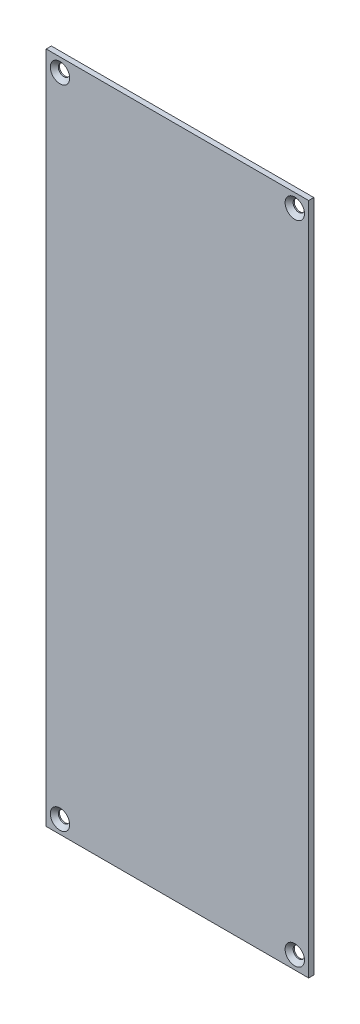
ISO-10303-21;
HEADER;
FILE_DESCRIPTION(('STEP AP214'),'2;1');
FILE_NAME('part.step','',(''),(''),'','','');
FILE_SCHEMA(('AUTOMOTIVE_DESIGN { 1 0 10303 214 1 1 1 1 }'));
ENDSEC;
DATA;
#1=APPLICATION_CONTEXT('core data for automotive mechanical design processes');
#2=APPLICATION_PROTOCOL_DEFINITION('international standard','automotive_design',2000,#1);
#3=PRODUCT_CONTEXT('',#1,'mechanical');
#4=PRODUCT('Part','Part','',(#3));
#5=PRODUCT_RELATED_PRODUCT_CATEGORY('part','',(#4));
#6=PRODUCT_DEFINITION_FORMATION('','',#4);
#7=PRODUCT_DEFINITION_CONTEXT('part definition',#1,'design');
#8=PRODUCT_DEFINITION('design','',#6,#7);
#9=PRODUCT_DEFINITION_SHAPE('','',#8);
#10=(LENGTH_UNIT() NAMED_UNIT(*) SI_UNIT(.MILLI.,.METRE.));
#11=(NAMED_UNIT(*) PLANE_ANGLE_UNIT() SI_UNIT($,.RADIAN.));
#12=(NAMED_UNIT(*) SI_UNIT($,.STERADIAN.) SOLID_ANGLE_UNIT());
#13=UNCERTAINTY_MEASURE_WITH_UNIT(LENGTH_MEASURE(1.E-05),#10,'distance_accuracy_value','');
#14=(GEOMETRIC_REPRESENTATION_CONTEXT(3) GLOBAL_UNCERTAINTY_ASSIGNED_CONTEXT((#13)) GLOBAL_UNIT_ASSIGNED_CONTEXT((#10,
#11,#12)) REPRESENTATION_CONTEXT('',''));
#15=CARTESIAN_POINT('',(0.,0.,0.));
#16=DIRECTION('',(0.,0.,1.));
#17=DIRECTION('',(1.,0.,0.));
#18=AXIS2_PLACEMENT_3D('',#15,#16,#17);
#19=CARTESIAN_POINT('',(50.8,130.33,1.));
#20=DIRECTION('',(0.,-1.,0.));
#21=DIRECTION('',(0.,0.,-1.));
#22=AXIS2_PLACEMENT_3D('',#19,#20,#21);
#23=PLANE('',#22);
#24=DIRECTION('',(-1.,0.,0.));
#25=VECTOR('',#24,1.);
#26=CARTESIAN_POINT('',(50.8,130.33,0.));
#27=LINE('',#26,#25);
#28=CARTESIAN_POINT('',(50.8,130.33,0.));
#29=VERTEX_POINT('',#28);
#30=CARTESIAN_POINT('',(0.,130.33,0.));
#31=VERTEX_POINT('',#30);
#32=EDGE_CURVE('E98',#29,#31,#27,.T.);
#33=ORIENTED_EDGE('',*,*,#32,.T.);
#34=DIRECTION('',(0.,0.,-1.));
#35=VECTOR('',#34,1.);
#36=CARTESIAN_POINT('',(0.,130.33,1.));
#37=LINE('',#36,#35);
#38=CARTESIAN_POINT('',(0.,130.33,1.));
#39=VERTEX_POINT('',#38);
#40=EDGE_CURVE('E11',#39,#31,#37,.T.);
#41=ORIENTED_EDGE('',*,*,#40,.F.);
#42=DIRECTION('',(-1.,0.,0.));
#43=VECTOR('',#42,1.);
#44=CARTESIAN_POINT('',(50.8,130.33,1.));
#45=LINE('',#44,#43);
#46=CARTESIAN_POINT('',(50.8,130.33,1.));
#47=VERTEX_POINT('',#46);
#48=EDGE_CURVE('E86',#47,#39,#45,.T.);
#49=ORIENTED_EDGE('',*,*,#48,.F.);
#50=DIRECTION('',(0.,0.,-1.));
#51=VECTOR('',#50,1.);
#52=CARTESIAN_POINT('',(50.8,130.33,1.));
#53=LINE('',#52,#51);
#54=EDGE_CURVE('E94',#47,#29,#53,.T.);
#55=ORIENTED_EDGE('',*,*,#54,.T.);
#56=EDGE_LOOP('',(#33,#41,#49,#55));
#57=FACE_BOUND('',#56,.T.);
#58=ADVANCED_FACE('F35',(#57),#23,.F.);
#59=CARTESIAN_POINT('',(0.,130.33,1.));
#60=DIRECTION('',(1.,0.,0.));
#61=DIRECTION('',(0.,1.,0.));
#62=AXIS2_PLACEMENT_3D('',#59,#60,#61);
#63=PLANE('',#62);
#64=DIRECTION('',(0.,-1.,0.));
#65=VECTOR('',#64,1.);
#66=CARTESIAN_POINT('',(0.,130.33,0.));
#67=LINE('',#66,#65);
#68=CARTESIAN_POINT('',(0.,0.,0.));
#69=VERTEX_POINT('',#68);
#70=EDGE_CURVE('E90',#31,#69,#67,.T.);
#71=ORIENTED_EDGE('',*,*,#70,.T.);
#72=DIRECTION('',(0.,0.,-1.));
#73=VECTOR('',#72,1.);
#74=CARTESIAN_POINT('',(0.,0.,1.));
#75=LINE('',#74,#73);
#76=CARTESIAN_POINT('',(0.,0.,1.));
#77=VERTEX_POINT('',#76);
#78=EDGE_CURVE('E43',#77,#69,#75,.T.);
#79=ORIENTED_EDGE('',*,*,#78,.F.);
#80=DIRECTION('',(0.,-1.,0.));
#81=VECTOR('',#80,1.);
#82=CARTESIAN_POINT('',(0.,130.33,1.));
#83=LINE('',#82,#81);
#84=EDGE_CURVE('E81',#39,#77,#83,.T.);
#85=ORIENTED_EDGE('',*,*,#84,.F.);
#86=ORIENTED_EDGE('',*,*,#40,.T.);
#87=EDGE_LOOP('',(#71,#79,#85,#86));
#88=FACE_BOUND('',#87,.T.);
#89=ADVANCED_FACE('F89',(#88),#63,.F.);
#90=CARTESIAN_POINT('',(0.,0.,1.));
#91=DIRECTION('',(0.,1.,0.));
#92=DIRECTION('',(0.,0.,1.));
#93=AXIS2_PLACEMENT_3D('',#90,#91,#92);
#94=PLANE('',#93);
#95=DIRECTION('',(1.,0.,0.));
#96=VECTOR('',#95,1.);
#97=CARTESIAN_POINT('',(0.,0.,0.));
#98=LINE('',#97,#96);
#99=CARTESIAN_POINT('',(50.8,0.,0.));
#100=VERTEX_POINT('',#99);
#101=EDGE_CURVE('E68',#69,#100,#98,.T.);
#102=ORIENTED_EDGE('',*,*,#101,.T.);
#103=DIRECTION('',(0.,0.,-1.));
#104=VECTOR('',#103,1.);
#105=CARTESIAN_POINT('',(50.8,0.,1.));
#106=LINE('',#105,#104);
#107=CARTESIAN_POINT('',(50.8,0.,1.));
#108=VERTEX_POINT('',#107);
#109=EDGE_CURVE('E91',#108,#100,#106,.T.);
#110=ORIENTED_EDGE('',*,*,#109,.F.);
#111=DIRECTION('',(1.,0.,0.));
#112=VECTOR('',#111,1.);
#113=CARTESIAN_POINT('',(0.,0.,1.));
#114=LINE('',#113,#112);
#115=EDGE_CURVE('E84',#77,#108,#114,.T.);
#116=ORIENTED_EDGE('',*,*,#115,.F.);
#117=ORIENTED_EDGE('',*,*,#78,.T.);
#118=EDGE_LOOP('',(#102,#110,#116,#117));
#119=FACE_BOUND('',#118,.T.);
#120=ADVANCED_FACE('F92',(#119),#94,.F.);
#121=CARTESIAN_POINT('',(50.8,0.,1.));
#122=DIRECTION('',(-1.,0.,0.));
#123=DIRECTION('',(0.,0.,1.));
#124=AXIS2_PLACEMENT_3D('',#121,#122,#123);
#125=PLANE('',#124);
#126=DIRECTION('',(0.,1.,0.));
#127=VECTOR('',#126,1.);
#128=CARTESIAN_POINT('',(50.8,0.,0.));
#129=LINE('',#128,#127);
#130=EDGE_CURVE('E74',#100,#29,#129,.T.);
#131=ORIENTED_EDGE('',*,*,#130,.T.);
#132=ORIENTED_EDGE('',*,*,#54,.F.);
#133=DIRECTION('',(0.,1.,0.));
#134=VECTOR('',#133,1.);
#135=CARTESIAN_POINT('',(50.8,0.,1.));
#136=LINE('',#135,#134);
#137=EDGE_CURVE('E51',#108,#47,#136,.T.);
#138=ORIENTED_EDGE('',*,*,#137,.F.);
#139=ORIENTED_EDGE('',*,*,#109,.T.);
#140=EDGE_LOOP('',(#131,#132,#138,#139));
#141=FACE_BOUND('',#140,.T.);
#142=ADVANCED_FACE('F106',(#141),#125,.F.);
#143=CARTESIAN_POINT('',(0.,0.,1.));
#144=DIRECTION('',(0.,0.,1.));
#145=DIRECTION('',(1.,0.,0.));
#146=AXIS2_PLACEMENT_3D('',#143,#144,#145);
#147=PLANE('',#146);
#148=CARTESIAN_POINT('',(48.1225,127.7025,1.));
#149=DIRECTION('',(0.,0.,1.));
#150=DIRECTION('',(1.,0.,0.));
#151=AXIS2_PLACEMENT_3D('',#148,#149,#150);
#152=CIRCLE('',#151,1.875);
#153=CARTESIAN_POINT('',(49.9975,127.7025,1.));
#154=VERTEX_POINT('',#153);
#155=EDGE_CURVE('E144',#154,#154,#152,.T.);
#156=ORIENTED_EDGE('',*,*,#155,.F.);
#157=EDGE_LOOP('',(#156));
#158=FACE_BOUND('',#157,.T.);
#159=CARTESIAN_POINT('',(2.67249999999999,2.5625,1.));
#160=DIRECTION('',(0.,0.,1.));
#161=DIRECTION('',(1.,0.,0.));
#162=AXIS2_PLACEMENT_3D('',#159,#160,#161);
#163=CIRCLE('',#162,1.875);
#164=CARTESIAN_POINT('',(4.54749999999999,2.5625,1.));
#165=VERTEX_POINT('',#164);
#166=EDGE_CURVE('E135',#165,#165,#163,.T.);
#167=ORIENTED_EDGE('',*,*,#166,.F.);
#168=EDGE_LOOP('',(#167));
#169=FACE_BOUND('',#168,.T.);
#170=CARTESIAN_POINT('',(48.1225,2.5625,1.));
#171=DIRECTION('',(0.,0.,1.));
#172=DIRECTION('',(1.,0.,0.));
#173=AXIS2_PLACEMENT_3D('',#170,#171,#172);
#174=CIRCLE('',#173,1.875);
#175=CARTESIAN_POINT('',(49.9975,2.5625,1.));
#176=VERTEX_POINT('',#175);
#177=EDGE_CURVE('E126',#176,#176,#174,.T.);
#178=ORIENTED_EDGE('',*,*,#177,.F.);
#179=EDGE_LOOP('',(#178));
#180=FACE_BOUND('',#179,.T.);
#181=CARTESIAN_POINT('',(2.67249999999999,127.7025,1.));
#182=DIRECTION('',(0.,0.,1.));
#183=DIRECTION('',(1.,0.,0.));
#184=AXIS2_PLACEMENT_3D('',#181,#182,#183);
#185=CIRCLE('',#184,1.875);
#186=CARTESIAN_POINT('',(4.54749999999999,127.7025,1.));
#187=VERTEX_POINT('',#186);
#188=EDGE_CURVE('E117',#187,#187,#185,.T.);
#189=ORIENTED_EDGE('',*,*,#188,.F.);
#190=EDGE_LOOP('',(#189));
#191=FACE_BOUND('',#190,.T.);
#192=ORIENTED_EDGE('',*,*,#48,.T.);
#193=ORIENTED_EDGE('',*,*,#84,.T.);
#194=ORIENTED_EDGE('',*,*,#115,.T.);
#195=ORIENTED_EDGE('',*,*,#137,.T.);
#196=EDGE_LOOP('',(#192,#193,#194,#195));
#197=FACE_BOUND('',#196,.T.);
#198=ADVANCED_FACE('F82',(#158,#169,#180,#191,#197),#147,.T.);
#199=CARTESIAN_POINT('',(0.,0.,0.));
#200=DIRECTION('',(0.,0.,1.));
#201=DIRECTION('',(1.,0.,0.));
#202=AXIS2_PLACEMENT_3D('',#199,#200,#201);
#203=PLANE('',#202);
#204=CARTESIAN_POINT('',(48.1225,127.7025,0.));
#205=DIRECTION('',(0.,0.,1.));
#206=DIRECTION('',(1.,0.,0.));
#207=AXIS2_PLACEMENT_3D('',#204,#205,#206);
#208=CIRCLE('',#207,1.1);
#209=CARTESIAN_POINT('',(49.2225,127.7025,0.));
#210=VERTEX_POINT('',#209);
#211=EDGE_CURVE('E138',#210,#210,#208,.T.);
#212=ORIENTED_EDGE('',*,*,#211,.T.);
#213=EDGE_LOOP('',(#212));
#214=FACE_BOUND('',#213,.T.);
#215=CARTESIAN_POINT('',(2.67249999999999,2.5625,0.));
#216=DIRECTION('',(0.,0.,1.));
#217=DIRECTION('',(1.,0.,0.));
#218=AXIS2_PLACEMENT_3D('',#215,#216,#217);
#219=CIRCLE('',#218,1.1);
#220=CARTESIAN_POINT('',(3.77249999999999,2.5625,0.));
#221=VERTEX_POINT('',#220);
#222=EDGE_CURVE('E129',#221,#221,#219,.T.);
#223=ORIENTED_EDGE('',*,*,#222,.T.);
#224=EDGE_LOOP('',(#223));
#225=FACE_BOUND('',#224,.T.);
#226=CARTESIAN_POINT('',(48.1225,2.5625,0.));
#227=DIRECTION('',(0.,0.,1.));
#228=DIRECTION('',(1.,0.,0.));
#229=AXIS2_PLACEMENT_3D('',#226,#227,#228);
#230=CIRCLE('',#229,1.1);
#231=CARTESIAN_POINT('',(49.2225,2.5625,0.));
#232=VERTEX_POINT('',#231);
#233=EDGE_CURVE('E120',#232,#232,#230,.T.);
#234=ORIENTED_EDGE('',*,*,#233,.T.);
#235=EDGE_LOOP('',(#234));
#236=FACE_BOUND('',#235,.T.);
#237=CARTESIAN_POINT('',(2.67249999999999,127.7025,0.));
#238=DIRECTION('',(0.,0.,1.));
#239=DIRECTION('',(1.,0.,0.));
#240=AXIS2_PLACEMENT_3D('',#237,#238,#239);
#241=CIRCLE('',#240,1.1);
#242=CARTESIAN_POINT('',(3.77249999999999,127.7025,0.));
#243=VERTEX_POINT('',#242);
#244=EDGE_CURVE('E101',#243,#243,#241,.T.);
#245=ORIENTED_EDGE('',*,*,#244,.T.);
#246=EDGE_LOOP('',(#245));
#247=FACE_BOUND('',#246,.T.);
#248=ORIENTED_EDGE('',*,*,#32,.F.);
#249=ORIENTED_EDGE('',*,*,#130,.F.);
#250=ORIENTED_EDGE('',*,*,#101,.F.);
#251=ORIENTED_EDGE('',*,*,#70,.F.);
#252=EDGE_LOOP('',(#248,#249,#250,#251));
#253=FACE_BOUND('',#252,.T.);
#254=ADVANCED_FACE('F109',(#214,#225,#236,#247,#253),#203,.F.);
#255=CARTESIAN_POINT('',(2.67249999999999,127.7025,1.));
#256=DIRECTION('',(0.,0.,1.));
#257=DIRECTION('',(1.,0.,0.));
#258=AXIS2_PLACEMENT_3D('',#255,#256,#257);
#259=CYLINDRICAL_SURFACE('',#258,1.1);
#260=ORIENTED_EDGE('',*,*,#244,.F.);
#261=EDGE_LOOP('',(#260));
#262=FACE_BOUND('',#261,.T.);
#263=CARTESIAN_POINT('',(2.67249999999999,127.7025,0.225));
#264=DIRECTION('',(0.,0.,1.));
#265=DIRECTION('',(1.,0.,0.));
#266=AXIS2_PLACEMENT_3D('',#263,#264,#265);
#267=CIRCLE('',#266,1.1);
#268=CARTESIAN_POINT('',(3.77249999999999,127.7025,0.225));
#269=VERTEX_POINT('',#268);
#270=EDGE_CURVE('E114',#269,#269,#267,.T.);
#271=ORIENTED_EDGE('',*,*,#270,.T.);
#272=EDGE_LOOP('',(#271));
#273=FACE_BOUND('',#272,.T.);
#274=ADVANCED_FACE('F162',(#262,#273),#259,.F.);
#275=CARTESIAN_POINT('',(2.67249999999999,127.7025,1.));
#276=DIRECTION('',(0.,0.,1.));
#277=DIRECTION('',(1.,0.,0.));
#278=AXIS2_PLACEMENT_3D('',#275,#276,#277);
#279=CONICAL_SURFACE('',#278,1.875,0.785398163397449);
#280=ORIENTED_EDGE('',*,*,#270,.F.);
#281=EDGE_LOOP('',(#280));
#282=FACE_BOUND('',#281,.T.);
#283=ORIENTED_EDGE('',*,*,#188,.T.);
#284=EDGE_LOOP('',(#283));
#285=FACE_BOUND('',#284,.T.);
#286=ADVANCED_FACE('F159',(#282,#285),#279,.F.);
#287=CARTESIAN_POINT('',(48.1225,2.5625,1.));
#288=DIRECTION('',(0.,0.,1.));
#289=DIRECTION('',(1.,0.,0.));
#290=AXIS2_PLACEMENT_3D('',#287,#288,#289);
#291=CYLINDRICAL_SURFACE('',#290,1.1);
#292=ORIENTED_EDGE('',*,*,#233,.F.);
#293=EDGE_LOOP('',(#292));
#294=FACE_BOUND('',#293,.T.);
#295=CARTESIAN_POINT('',(48.1225,2.5625,0.225));
#296=DIRECTION('',(0.,0.,1.));
#297=DIRECTION('',(1.,0.,0.));
#298=AXIS2_PLACEMENT_3D('',#295,#296,#297);
#299=CIRCLE('',#298,1.1);
#300=CARTESIAN_POINT('',(49.2225,2.5625,0.225));
#301=VERTEX_POINT('',#300);
#302=EDGE_CURVE('E123',#301,#301,#299,.T.);
#303=ORIENTED_EDGE('',*,*,#302,.T.);
#304=EDGE_LOOP('',(#303));
#305=FACE_BOUND('',#304,.T.);
#306=ADVANCED_FACE('F161',(#294,#305),#291,.F.);
#307=CARTESIAN_POINT('',(48.1225,2.5625,1.));
#308=DIRECTION('',(0.,0.,1.));
#309=DIRECTION('',(1.,0.,0.));
#310=AXIS2_PLACEMENT_3D('',#307,#308,#309);
#311=CONICAL_SURFACE('',#310,1.875,0.785398163397452);
#312=ORIENTED_EDGE('',*,*,#302,.F.);
#313=EDGE_LOOP('',(#312));
#314=FACE_BOUND('',#313,.T.);
#315=ORIENTED_EDGE('',*,*,#177,.T.);
#316=EDGE_LOOP('',(#315));
#317=FACE_BOUND('',#316,.T.);
#318=ADVANCED_FACE('F169',(#314,#317),#311,.F.);
#319=CARTESIAN_POINT('',(2.67249999999999,2.5625,1.));
#320=DIRECTION('',(0.,0.,1.));
#321=DIRECTION('',(1.,0.,0.));
#322=AXIS2_PLACEMENT_3D('',#319,#320,#321);
#323=CYLINDRICAL_SURFACE('',#322,1.1);
#324=ORIENTED_EDGE('',*,*,#222,.F.);
#325=EDGE_LOOP('',(#324));
#326=FACE_BOUND('',#325,.T.);
#327=CARTESIAN_POINT('',(2.67249999999999,2.5625,0.225));
#328=DIRECTION('',(0.,0.,1.));
#329=DIRECTION('',(1.,0.,0.));
#330=AXIS2_PLACEMENT_3D('',#327,#328,#329);
#331=CIRCLE('',#330,1.1);
#332=CARTESIAN_POINT('',(3.77249999999999,2.5625,0.225));
#333=VERTEX_POINT('',#332);
#334=EDGE_CURVE('E132',#333,#333,#331,.T.);
#335=ORIENTED_EDGE('',*,*,#334,.T.);
#336=EDGE_LOOP('',(#335));
#337=FACE_BOUND('',#336,.T.);
#338=ADVANCED_FACE('F203',(#326,#337),#323,.F.);
#339=CARTESIAN_POINT('',(2.67249999999999,2.5625,1.));
#340=DIRECTION('',(0.,0.,1.));
#341=DIRECTION('',(1.,0.,0.));
#342=AXIS2_PLACEMENT_3D('',#339,#340,#341);
#343=CONICAL_SURFACE('',#342,1.875,0.785398163397449);
#344=ORIENTED_EDGE('',*,*,#334,.F.);
#345=EDGE_LOOP('',(#344));
#346=FACE_BOUND('',#345,.T.);
#347=ORIENTED_EDGE('',*,*,#166,.T.);
#348=EDGE_LOOP('',(#347));
#349=FACE_BOUND('',#348,.T.);
#350=ADVANCED_FACE('F208',(#346,#349),#343,.F.);
#351=CARTESIAN_POINT('',(48.1225,127.7025,1.));
#352=DIRECTION('',(0.,0.,1.));
#353=DIRECTION('',(1.,0.,0.));
#354=AXIS2_PLACEMENT_3D('',#351,#352,#353);
#355=CYLINDRICAL_SURFACE('',#354,1.1);
#356=ORIENTED_EDGE('',*,*,#211,.F.);
#357=EDGE_LOOP('',(#356));
#358=FACE_BOUND('',#357,.T.);
#359=CARTESIAN_POINT('',(48.1225,127.7025,0.225));
#360=DIRECTION('',(0.,0.,1.));
#361=DIRECTION('',(1.,0.,0.));
#362=AXIS2_PLACEMENT_3D('',#359,#360,#361);
#363=CIRCLE('',#362,1.1);
#364=CARTESIAN_POINT('',(49.2225,127.7025,0.225));
#365=VERTEX_POINT('',#364);
#366=EDGE_CURVE('E141',#365,#365,#363,.T.);
#367=ORIENTED_EDGE('',*,*,#366,.T.);
#368=EDGE_LOOP('',(#367));
#369=FACE_BOUND('',#368,.T.);
#370=ADVANCED_FACE('F214',(#358,#369),#355,.F.);
#371=CARTESIAN_POINT('',(48.1225,127.7025,1.));
#372=DIRECTION('',(0.,0.,1.));
#373=DIRECTION('',(1.,0.,0.));
#374=AXIS2_PLACEMENT_3D('',#371,#372,#373);
#375=CONICAL_SURFACE('',#374,1.875,0.785398163397452);
#376=ORIENTED_EDGE('',*,*,#366,.F.);
#377=EDGE_LOOP('',(#376));
#378=FACE_BOUND('',#377,.T.);
#379=ORIENTED_EDGE('',*,*,#155,.T.);
#380=EDGE_LOOP('',(#379));
#381=FACE_BOUND('',#380,.T.);
#382=ADVANCED_FACE('F148',(#378,#381),#375,.F.);
#383=CLOSED_SHELL('',(#58,#89,#120,#142,#198,#254,#274,#286,#306,#318,#338,#350,#370,#382));
#384=MANIFOLD_SOLID_BREP('B2',#383);
#385=ADVANCED_BREP_SHAPE_REPRESENTATION('',(#18,#384),#14);
#386=SHAPE_DEFINITION_REPRESENTATION(#9,#385);
ENDSEC;
END-ISO-10303-21;
